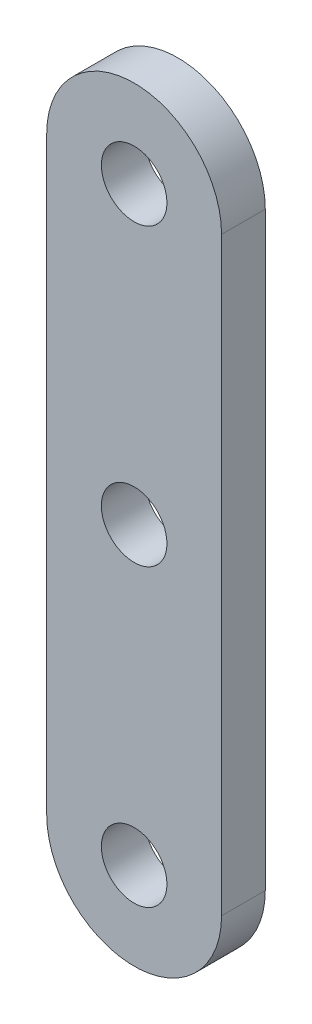
ISO-10303-21;
HEADER;
FILE_DESCRIPTION(('STEP AP214'),'2;1');
FILE_NAME('part.step','',(''),(''),'','','');
FILE_SCHEMA(('AUTOMOTIVE_DESIGN { 1 0 10303 214 1 1 1 1 }'));
ENDSEC;
DATA;
#1=APPLICATION_CONTEXT('core data for automotive mechanical design processes');
#2=APPLICATION_PROTOCOL_DEFINITION('international standard','automotive_design',2000,#1);
#3=PRODUCT_CONTEXT('',#1,'mechanical');
#4=PRODUCT('Part','Part','',(#3));
#5=PRODUCT_RELATED_PRODUCT_CATEGORY('part','',(#4));
#6=PRODUCT_DEFINITION_FORMATION('','',#4);
#7=PRODUCT_DEFINITION_CONTEXT('part definition',#1,'design');
#8=PRODUCT_DEFINITION('design','',#6,#7);
#9=PRODUCT_DEFINITION_SHAPE('','',#8);
#10=(LENGTH_UNIT() NAMED_UNIT(*) SI_UNIT(.MILLI.,.METRE.));
#11=(NAMED_UNIT(*) PLANE_ANGLE_UNIT() SI_UNIT($,.RADIAN.));
#12=(NAMED_UNIT(*) SI_UNIT($,.STERADIAN.) SOLID_ANGLE_UNIT());
#13=UNCERTAINTY_MEASURE_WITH_UNIT(LENGTH_MEASURE(1.E-05),#10,'distance_accuracy_value','');
#14=(GEOMETRIC_REPRESENTATION_CONTEXT(3) GLOBAL_UNCERTAINTY_ASSIGNED_CONTEXT((#13)) GLOBAL_UNIT_ASSIGNED_CONTEXT((#10,
#11,#12)) REPRESENTATION_CONTEXT('',''));
#15=CARTESIAN_POINT('',(0.,0.,0.));
#16=DIRECTION('',(0.,0.,1.));
#17=DIRECTION('',(1.,0.,0.));
#18=AXIS2_PLACEMENT_3D('',#15,#16,#17);
#19=CARTESIAN_POINT('',(6.35,0.,3.175));
#20=DIRECTION('',(-1.,0.,0.));
#21=DIRECTION('',(0.,0.,1.));
#22=AXIS2_PLACEMENT_3D('',#19,#20,#21);
#23=PLANE('',#22);
#24=DIRECTION('',(0.,1.,0.));
#25=VECTOR('',#24,1.);
#26=CARTESIAN_POINT('',(6.35,0.,0.));
#27=LINE('',#26,#25);
#28=CARTESIAN_POINT('',(6.35,0.,0.));
#29=VERTEX_POINT('',#28);
#30=CARTESIAN_POINT('',(6.35,42.8625,0.));
#31=VERTEX_POINT('',#30);
#32=EDGE_CURVE('E105',#29,#31,#27,.T.);
#33=ORIENTED_EDGE('',*,*,#32,.T.);
#34=DIRECTION('',(0.,0.,-1.));
#35=VECTOR('',#34,1.);
#36=CARTESIAN_POINT('',(6.35,42.8625,3.175));
#37=LINE('',#36,#35);
#38=CARTESIAN_POINT('',(6.35,42.8625,3.175));
#39=VERTEX_POINT('',#38);
#40=EDGE_CURVE('E11',#39,#31,#37,.T.);
#41=ORIENTED_EDGE('',*,*,#40,.F.);
#42=DIRECTION('',(0.,1.,0.));
#43=VECTOR('',#42,1.);
#44=CARTESIAN_POINT('',(6.35,0.,3.175));
#45=LINE('',#44,#43);
#46=CARTESIAN_POINT('',(6.35,0.,3.175));
#47=VERTEX_POINT('',#46);
#48=EDGE_CURVE('E81',#47,#39,#45,.T.);
#49=ORIENTED_EDGE('',*,*,#48,.F.);
#50=DIRECTION('',(0.,0.,-1.));
#51=VECTOR('',#50,1.);
#52=CARTESIAN_POINT('',(6.35,0.,3.175));
#53=LINE('',#52,#51);
#54=EDGE_CURVE('E92',#47,#29,#53,.T.);
#55=ORIENTED_EDGE('',*,*,#54,.T.);
#56=EDGE_LOOP('',(#33,#41,#49,#55));
#57=FACE_BOUND('',#56,.T.);
#58=ADVANCED_FACE('F33',(#57),#23,.F.);
#59=CARTESIAN_POINT('',(0.,42.8625,3.175));
#60=DIRECTION('',(0.,0.,-1.));
#61=DIRECTION('',(-1.,0.,0.));
#62=AXIS2_PLACEMENT_3D('',#59,#60,#61);
#63=CYLINDRICAL_SURFACE('',#62,6.35);
#64=CARTESIAN_POINT('',(0.,42.8625,0.));
#65=DIRECTION('',(0.,0.,1.));
#66=DIRECTION('',(1.,0.,0.));
#67=AXIS2_PLACEMENT_3D('',#64,#65,#66);
#68=CIRCLE('',#67,6.35);
#69=CARTESIAN_POINT('',(-6.35,42.8625,0.));
#70=VERTEX_POINT('',#69);
#71=EDGE_CURVE('E86',#31,#70,#68,.T.);
#72=ORIENTED_EDGE('',*,*,#71,.T.);
#73=DIRECTION('',(0.,0.,-1.));
#74=VECTOR('',#73,1.);
#75=CARTESIAN_POINT('',(-6.35,42.8625,3.175));
#76=LINE('',#75,#74);
#77=CARTESIAN_POINT('',(-6.35,42.8625,3.175));
#78=VERTEX_POINT('',#77);
#79=EDGE_CURVE('E42',#78,#70,#76,.T.);
#80=ORIENTED_EDGE('',*,*,#79,.F.);
#81=CARTESIAN_POINT('',(0.,42.8625,3.175));
#82=DIRECTION('',(0.,0.,1.));
#83=DIRECTION('',(1.,0.,0.));
#84=AXIS2_PLACEMENT_3D('',#81,#82,#83);
#85=CIRCLE('',#84,6.35);
#86=EDGE_CURVE('E76',#39,#78,#85,.T.);
#87=ORIENTED_EDGE('',*,*,#86,.F.);
#88=ORIENTED_EDGE('',*,*,#40,.T.);
#89=EDGE_LOOP('',(#72,#80,#87,#88));
#90=FACE_BOUND('',#89,.T.);
#91=ADVANCED_FACE('F85',(#90),#63,.T.);
#92=CARTESIAN_POINT('',(-6.35,0.,3.175));
#93=DIRECTION('',(-1.,0.,0.));
#94=DIRECTION('',(0.,0.,1.));
#95=AXIS2_PLACEMENT_3D('',#92,#93,#94);
#96=PLANE('',#95);
#97=DIRECTION('',(0.,1.,0.));
#98=VECTOR('',#97,1.);
#99=CARTESIAN_POINT('',(-6.35,0.,0.));
#100=LINE('',#99,#98);
#101=CARTESIAN_POINT('',(-6.35,0.,0.));
#102=VERTEX_POINT('',#101);
#103=EDGE_CURVE('E109',#102,#70,#100,.T.);
#104=ORIENTED_EDGE('',*,*,#103,.F.);
#105=DIRECTION('',(0.,0.,-1.));
#106=VECTOR('',#105,1.);
#107=CARTESIAN_POINT('',(-6.35,0.,3.175));
#108=LINE('',#107,#106);
#109=CARTESIAN_POINT('',(-6.35,0.,3.175));
#110=VERTEX_POINT('',#109);
#111=EDGE_CURVE('E66',#110,#102,#108,.T.);
#112=ORIENTED_EDGE('',*,*,#111,.F.);
#113=DIRECTION('',(0.,1.,0.));
#114=VECTOR('',#113,1.);
#115=CARTESIAN_POINT('',(-6.35,0.,3.175));
#116=LINE('',#115,#114);
#117=EDGE_CURVE('E79',#110,#78,#116,.T.);
#118=ORIENTED_EDGE('',*,*,#117,.T.);
#119=ORIENTED_EDGE('',*,*,#79,.T.);
#120=EDGE_LOOP('',(#104,#112,#118,#119));
#121=FACE_BOUND('',#120,.T.);
#122=ADVANCED_FACE('F90',(#121),#96,.T.);
#123=CARTESIAN_POINT('',(0.,0.,3.175));
#124=DIRECTION('',(0.,0.,-1.));
#125=DIRECTION('',(-1.,0.,0.));
#126=AXIS2_PLACEMENT_3D('',#123,#124,#125);
#127=CYLINDRICAL_SURFACE('',#126,2.38125);
#128=CARTESIAN_POINT('',(0.,0.,3.175));
#129=DIRECTION('',(0.,0.,1.));
#130=DIRECTION('',(1.,0.,0.));
#131=AXIS2_PLACEMENT_3D('',#128,#129,#130);
#132=CIRCLE('',#131,2.38125);
#133=CARTESIAN_POINT('',(2.38125,0.,3.175));
#134=VERTEX_POINT('',#133);
#135=EDGE_CURVE('E156',#134,#134,#132,.T.);
#136=ORIENTED_EDGE('',*,*,#135,.T.);
#137=EDGE_LOOP('',(#136));
#138=FACE_BOUND('',#137,.T.);
#139=CARTESIAN_POINT('',(0.,0.,0.));
#140=DIRECTION('',(0.,0.,1.));
#141=DIRECTION('',(1.,0.,0.));
#142=AXIS2_PLACEMENT_3D('',#139,#140,#141);
#143=CIRCLE('',#142,2.38125);
#144=CARTESIAN_POINT('',(2.38125,0.,0.));
#145=VERTEX_POINT('',#144);
#146=EDGE_CURVE('E102',#145,#145,#143,.T.);
#147=ORIENTED_EDGE('',*,*,#146,.F.);
#148=EDGE_LOOP('',(#147));
#149=FACE_BOUND('',#148,.T.);
#150=ADVANCED_FACE('F137',(#138,#149),#127,.F.);
#151=CARTESIAN_POINT('',(0.,21.43125,3.175));
#152=DIRECTION('',(0.,0.,-1.));
#153=DIRECTION('',(-1.,0.,0.));
#154=AXIS2_PLACEMENT_3D('',#151,#152,#153);
#155=CYLINDRICAL_SURFACE('',#154,2.38125);
#156=CARTESIAN_POINT('',(0.,21.43125,3.175));
#157=DIRECTION('',(0.,0.,1.));
#158=DIRECTION('',(1.,0.,0.));
#159=AXIS2_PLACEMENT_3D('',#156,#157,#158);
#160=CIRCLE('',#159,2.38125);
#161=CARTESIAN_POINT('',(2.38125,21.43125,3.175));
#162=VERTEX_POINT('',#161);
#163=EDGE_CURVE('E150',#162,#162,#160,.T.);
#164=ORIENTED_EDGE('',*,*,#163,.T.);
#165=EDGE_LOOP('',(#164));
#166=FACE_BOUND('',#165,.T.);
#167=CARTESIAN_POINT('',(0.,21.43125,0.));
#168=DIRECTION('',(0.,0.,1.));
#169=DIRECTION('',(1.,0.,0.));
#170=AXIS2_PLACEMENT_3D('',#167,#168,#169);
#171=CIRCLE('',#170,2.38125);
#172=CARTESIAN_POINT('',(2.38125,21.43125,0.));
#173=VERTEX_POINT('',#172);
#174=EDGE_CURVE('E99',#173,#173,#171,.T.);
#175=ORIENTED_EDGE('',*,*,#174,.F.);
#176=EDGE_LOOP('',(#175));
#177=FACE_BOUND('',#176,.T.);
#178=ADVANCED_FACE('F139',(#166,#177),#155,.F.);
#179=CARTESIAN_POINT('',(0.,42.8625,3.175));
#180=DIRECTION('',(0.,0.,-1.));
#181=DIRECTION('',(-1.,0.,0.));
#182=AXIS2_PLACEMENT_3D('',#179,#180,#181);
#183=CYLINDRICAL_SURFACE('',#182,2.38125);
#184=CARTESIAN_POINT('',(0.,42.8625,3.175));
#185=DIRECTION('',(0.,0.,1.));
#186=DIRECTION('',(1.,0.,0.));
#187=AXIS2_PLACEMENT_3D('',#184,#185,#186);
#188=CIRCLE('',#187,2.38125);
#189=CARTESIAN_POINT('',(2.38125,42.8625,3.175));
#190=VERTEX_POINT('',#189);
#191=EDGE_CURVE('E112',#190,#190,#188,.T.);
#192=ORIENTED_EDGE('',*,*,#191,.T.);
#193=EDGE_LOOP('',(#192));
#194=FACE_BOUND('',#193,.T.);
#195=CARTESIAN_POINT('',(0.,42.8625,0.));
#196=DIRECTION('',(0.,0.,1.));
#197=DIRECTION('',(1.,0.,0.));
#198=AXIS2_PLACEMENT_3D('',#195,#196,#197);
#199=CIRCLE('',#198,2.38125);
#200=CARTESIAN_POINT('',(2.38125,42.8625,0.));
#201=VERTEX_POINT('',#200);
#202=EDGE_CURVE('E96',#201,#201,#199,.T.);
#203=ORIENTED_EDGE('',*,*,#202,.F.);
#204=EDGE_LOOP('',(#203));
#205=FACE_BOUND('',#204,.T.);
#206=ADVANCED_FACE('F35',(#194,#205),#183,.F.);
#207=CARTESIAN_POINT('',(0.,0.,3.175));
#208=DIRECTION('',(0.,0.,-1.));
#209=DIRECTION('',(-1.,0.,0.));
#210=AXIS2_PLACEMENT_3D('',#207,#208,#209);
#211=CYLINDRICAL_SURFACE('',#210,6.35);
#212=CARTESIAN_POINT('',(0.,0.,0.));
#213=DIRECTION('',(0.,0.,1.));
#214=DIRECTION('',(1.,0.,0.));
#215=AXIS2_PLACEMENT_3D('',#212,#213,#214);
#216=CIRCLE('',#215,6.35);
#217=EDGE_CURVE('E69',#102,#29,#216,.T.);
#218=ORIENTED_EDGE('',*,*,#217,.T.);
#219=ORIENTED_EDGE('',*,*,#54,.F.);
#220=CARTESIAN_POINT('',(0.,0.,3.175));
#221=DIRECTION('',(0.,0.,1.));
#222=DIRECTION('',(1.,0.,0.));
#223=AXIS2_PLACEMENT_3D('',#220,#221,#222);
#224=CIRCLE('',#223,6.35);
#225=EDGE_CURVE('E50',#110,#47,#224,.T.);
#226=ORIENTED_EDGE('',*,*,#225,.F.);
#227=ORIENTED_EDGE('',*,*,#111,.T.);
#228=EDGE_LOOP('',(#218,#219,#226,#227));
#229=FACE_BOUND('',#228,.T.);
#230=ADVANCED_FACE('F124',(#229),#211,.T.);
#231=CARTESIAN_POINT('',(0.,0.,3.175));
#232=DIRECTION('',(0.,0.,1.));
#233=DIRECTION('',(1.,0.,0.));
#234=AXIS2_PLACEMENT_3D('',#231,#232,#233);
#235=PLANE('',#234);
#236=ORIENTED_EDGE('',*,*,#191,.F.);
#237=EDGE_LOOP('',(#236));
#238=FACE_BOUND('',#237,.T.);
#239=ORIENTED_EDGE('',*,*,#163,.F.);
#240=EDGE_LOOP('',(#239));
#241=FACE_BOUND('',#240,.T.);
#242=ORIENTED_EDGE('',*,*,#135,.F.);
#243=EDGE_LOOP('',(#242));
#244=FACE_BOUND('',#243,.T.);
#245=ORIENTED_EDGE('',*,*,#48,.T.);
#246=ORIENTED_EDGE('',*,*,#86,.T.);
#247=ORIENTED_EDGE('',*,*,#117,.F.);
#248=ORIENTED_EDGE('',*,*,#225,.T.);
#249=EDGE_LOOP('',(#245,#246,#247,#248));
#250=FACE_BOUND('',#249,.T.);
#251=ADVANCED_FACE('F77',(#238,#241,#244,#250),#235,.T.);
#252=CARTESIAN_POINT('',(0.,0.,0.));
#253=DIRECTION('',(0.,0.,1.));
#254=DIRECTION('',(1.,0.,0.));
#255=AXIS2_PLACEMENT_3D('',#252,#253,#254);
#256=PLANE('',#255);
#257=ORIENTED_EDGE('',*,*,#202,.T.);
#258=EDGE_LOOP('',(#257));
#259=FACE_BOUND('',#258,.T.);
#260=ORIENTED_EDGE('',*,*,#174,.T.);
#261=EDGE_LOOP('',(#260));
#262=FACE_BOUND('',#261,.T.);
#263=ORIENTED_EDGE('',*,*,#146,.T.);
#264=EDGE_LOOP('',(#263));
#265=FACE_BOUND('',#264,.T.);
#266=ORIENTED_EDGE('',*,*,#32,.F.);
#267=ORIENTED_EDGE('',*,*,#217,.F.);
#268=ORIENTED_EDGE('',*,*,#103,.T.);
#269=ORIENTED_EDGE('',*,*,#71,.F.);
#270=EDGE_LOOP('',(#266,#267,#268,#269));
#271=FACE_BOUND('',#270,.T.);
#272=ADVANCED_FACE('F117',(#259,#262,#265,#271),#256,.F.);
#273=CLOSED_SHELL('',(#58,#91,#122,#150,#178,#206,#230,#251,#272));
#274=MANIFOLD_SOLID_BREP('B2',#273);
#275=ADVANCED_BREP_SHAPE_REPRESENTATION('',(#18,#274),#14);
#276=SHAPE_DEFINITION_REPRESENTATION(#9,#275);
ENDSEC;
END-ISO-10303-21;
